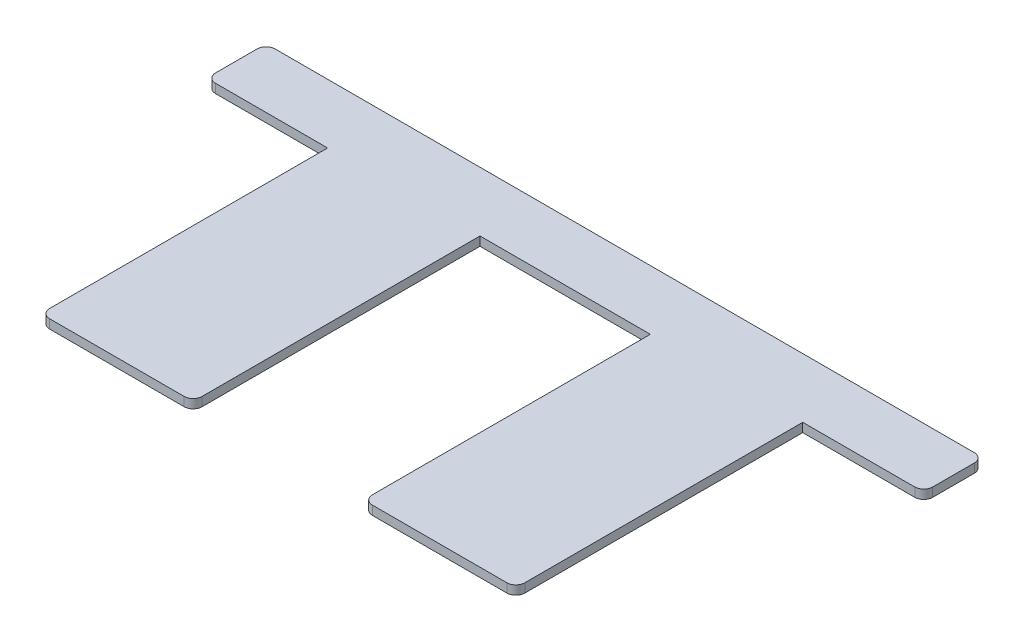
ISO-10303-21;
HEADER;
FILE_DESCRIPTION(('STEP AP214'),'2;1');
FILE_NAME('part.step','',(''),(''),'','','');
FILE_SCHEMA(('AUTOMOTIVE_DESIGN { 1 0 10303 214 1 1 1 1 }'));
ENDSEC;
DATA;
#1=APPLICATION_CONTEXT('core data for automotive mechanical design processes');
#2=APPLICATION_PROTOCOL_DEFINITION('international standard','automotive_design',2000,#1);
#3=PRODUCT_CONTEXT('',#1,'mechanical');
#4=PRODUCT('Part','Part','',(#3));
#5=PRODUCT_RELATED_PRODUCT_CATEGORY('part','',(#4));
#6=PRODUCT_DEFINITION_FORMATION('','',#4);
#7=PRODUCT_DEFINITION_CONTEXT('part definition',#1,'design');
#8=PRODUCT_DEFINITION('design','',#6,#7);
#9=PRODUCT_DEFINITION_SHAPE('','',#8);
#10=(LENGTH_UNIT() NAMED_UNIT(*) SI_UNIT(.MILLI.,.METRE.));
#11=(NAMED_UNIT(*) PLANE_ANGLE_UNIT() SI_UNIT($,.RADIAN.));
#12=(NAMED_UNIT(*) SI_UNIT($,.STERADIAN.) SOLID_ANGLE_UNIT());
#13=UNCERTAINTY_MEASURE_WITH_UNIT(LENGTH_MEASURE(1.E-05),#10,'distance_accuracy_value','');
#14=(GEOMETRIC_REPRESENTATION_CONTEXT(3) GLOBAL_UNCERTAINTY_ASSIGNED_CONTEXT((#13)) GLOBAL_UNIT_ASSIGNED_CONTEXT((#10,
#11,#12)) REPRESENTATION_CONTEXT('',''));
#15=CARTESIAN_POINT('',(0.,0.,0.));
#16=DIRECTION('',(0.,0.,1.));
#17=DIRECTION('',(1.,0.,0.));
#18=AXIS2_PLACEMENT_3D('',#15,#16,#17);
#19=CARTESIAN_POINT('',(0.,6.35,0.));
#20=DIRECTION('',(0.,1.,0.));
#21=DIRECTION('',(0.,0.,1.));
#22=AXIS2_PLACEMENT_3D('',#19,#20,#21);
#23=PLANE('',#22);
#24=DIRECTION('',(0.,0.,1.));
#25=VECTOR('',#24,1.);
#26=CARTESIAN_POINT('',(-254.,6.35,-21.082));
#27=LINE('',#26,#25);
#28=CARTESIAN_POINT('',(-254.,6.35,14.732));
#29=VERTEX_POINT('',#28);
#30=CARTESIAN_POINT('',(-254.,6.35,-14.732));
#31=VERTEX_POINT('',#30);
#32=EDGE_CURVE('E226',#29,#31,#27,.F.);
#33=ORIENTED_EDGE('',*,*,#32,.F.);
#34=CARTESIAN_POINT('',(-247.65,6.35,14.732));
#35=DIRECTION('',(0.,-1.,0.));
#36=DIRECTION('',(0.,0.,-1.));
#37=AXIS2_PLACEMENT_3D('',#34,#35,#36);
#38=CIRCLE('',#37,6.35);
#39=CARTESIAN_POINT('',(-247.65,6.35,21.082));
#40=VERTEX_POINT('',#39);
#41=EDGE_CURVE('E19',#40,#29,#38,.T.);
#42=ORIENTED_EDGE('',*,*,#41,.F.);
#43=DIRECTION('',(1.,0.,0.));
#44=VECTOR('',#43,1.);
#45=CARTESIAN_POINT('',(-254.,6.35,21.082));
#46=LINE('',#45,#44);
#47=CARTESIAN_POINT('',(-168.275,6.35,21.082));
#48=VERTEX_POINT('',#47);
#49=EDGE_CURVE('E134',#48,#40,#46,.F.);
#50=ORIENTED_EDGE('',*,*,#49,.F.);
#51=DIRECTION('',(0.,0.,1.));
#52=VECTOR('',#51,1.);
#53=CARTESIAN_POINT('',(-168.275,6.35,21.082));
#54=LINE('',#53,#52);
#55=CARTESIAN_POINT('',(-168.275,6.35,217.932));
#56=VERTEX_POINT('',#55);
#57=EDGE_CURVE('E141',#56,#48,#54,.F.);
#58=ORIENTED_EDGE('',*,*,#57,.F.);
#59=CARTESIAN_POINT('',(-161.925,6.35,217.932));
#60=DIRECTION('',(0.,-1.,0.));
#61=DIRECTION('',(0.,0.,-1.));
#62=AXIS2_PLACEMENT_3D('',#59,#60,#61);
#63=CIRCLE('',#62,6.35);
#64=CARTESIAN_POINT('',(-161.925,6.35,224.282));
#65=VERTEX_POINT('',#64);
#66=EDGE_CURVE('E281',#65,#56,#63,.T.);
#67=ORIENTED_EDGE('',*,*,#66,.F.);
#68=DIRECTION('',(1.,0.,0.));
#69=VECTOR('',#68,1.);
#70=CARTESIAN_POINT('',(0.,6.35,224.282));
#71=LINE('',#70,#69);
#72=CARTESIAN_POINT('',(-66.675,6.35,224.282));
#73=VERTEX_POINT('',#72);
#74=EDGE_CURVE('E278',#73,#65,#71,.F.);
#75=ORIENTED_EDGE('',*,*,#74,.F.);
#76=CARTESIAN_POINT('',(-66.675,6.35,217.932));
#77=DIRECTION('',(0.,1.,0.));
#78=DIRECTION('',(0.,0.,1.));
#79=AXIS2_PLACEMENT_3D('',#76,#77,#78);
#80=CIRCLE('',#79,6.35);
#81=CARTESIAN_POINT('',(-60.325,6.35,217.932));
#82=VERTEX_POINT('',#81);
#83=EDGE_CURVE('E275',#82,#73,#80,.F.);
#84=ORIENTED_EDGE('',*,*,#83,.F.);
#85=DIRECTION('',(0.,0.,-1.));
#86=VECTOR('',#85,1.);
#87=CARTESIAN_POINT('',(-60.325,6.35,21.082));
#88=LINE('',#87,#86);
#89=CARTESIAN_POINT('',(-60.325,6.35,21.082));
#90=VERTEX_POINT('',#89);
#91=EDGE_CURVE('E272',#90,#82,#88,.F.);
#92=ORIENTED_EDGE('',*,*,#91,.F.);
#93=DIRECTION('',(1.,0.,0.));
#94=VECTOR('',#93,1.);
#95=CARTESIAN_POINT('',(-254.,6.35,21.082));
#96=LINE('',#95,#94);
#97=CARTESIAN_POINT('',(60.325,6.35,21.082));
#98=VERTEX_POINT('',#97);
#99=EDGE_CURVE('E267',#98,#90,#96,.F.);
#100=ORIENTED_EDGE('',*,*,#99,.F.);
#101=DIRECTION('',(0.,0.,1.));
#102=VECTOR('',#101,1.);
#103=CARTESIAN_POINT('',(60.325,6.35,21.082));
#104=LINE('',#103,#102);
#105=CARTESIAN_POINT('',(60.325,6.35,217.932));
#106=VERTEX_POINT('',#105);
#107=EDGE_CURVE('E258',#106,#98,#104,.F.);
#108=ORIENTED_EDGE('',*,*,#107,.F.);
#109=CARTESIAN_POINT('',(66.675,6.35,217.932));
#110=DIRECTION('',(0.,-1.,0.));
#111=DIRECTION('',(0.,0.,-1.));
#112=AXIS2_PLACEMENT_3D('',#109,#110,#111);
#113=CIRCLE('',#112,6.35);
#114=CARTESIAN_POINT('',(66.675,6.35,224.282));
#115=VERTEX_POINT('',#114);
#116=EDGE_CURVE('E255',#115,#106,#113,.T.);
#117=ORIENTED_EDGE('',*,*,#116,.F.);
#118=DIRECTION('',(1.,0.,0.));
#119=VECTOR('',#118,1.);
#120=CARTESIAN_POINT('',(0.,6.35,224.282));
#121=LINE('',#120,#119);
#122=CARTESIAN_POINT('',(161.925,6.35,224.282));
#123=VERTEX_POINT('',#122);
#124=EDGE_CURVE('E252',#123,#115,#121,.F.);
#125=ORIENTED_EDGE('',*,*,#124,.F.);
#126=CARTESIAN_POINT('',(161.925,6.35,217.932));
#127=DIRECTION('',(0.,1.,0.));
#128=DIRECTION('',(0.,0.,1.));
#129=AXIS2_PLACEMENT_3D('',#126,#127,#128);
#130=CIRCLE('',#129,6.35);
#131=CARTESIAN_POINT('',(168.275,6.35,217.932));
#132=VERTEX_POINT('',#131);
#133=EDGE_CURVE('E249',#132,#123,#130,.F.);
#134=ORIENTED_EDGE('',*,*,#133,.F.);
#135=DIRECTION('',(0.,0.,-1.));
#136=VECTOR('',#135,1.);
#137=CARTESIAN_POINT('',(168.275,6.35,21.082));
#138=LINE('',#137,#136);
#139=CARTESIAN_POINT('',(168.275,6.35,21.082));
#140=VERTEX_POINT('',#139);
#141=EDGE_CURVE('E246',#140,#132,#138,.F.);
#142=ORIENTED_EDGE('',*,*,#141,.F.);
#143=DIRECTION('',(1.,0.,0.));
#144=VECTOR('',#143,1.);
#145=CARTESIAN_POINT('',(-254.,6.35,21.082));
#146=LINE('',#145,#144);
#147=CARTESIAN_POINT('',(247.65,6.35,21.082));
#148=VERTEX_POINT('',#147);
#149=EDGE_CURVE('E164',#148,#140,#146,.F.);
#150=ORIENTED_EDGE('',*,*,#149,.F.);
#151=CARTESIAN_POINT('',(247.65,6.35,14.732));
#152=DIRECTION('',(0.,-1.,0.));
#153=DIRECTION('',(0.,0.,-1.));
#154=AXIS2_PLACEMENT_3D('',#151,#152,#153);
#155=CIRCLE('',#154,6.35);
#156=CARTESIAN_POINT('',(254.,6.35,14.732));
#157=VERTEX_POINT('',#156);
#158=EDGE_CURVE('E168',#157,#148,#155,.T.);
#159=ORIENTED_EDGE('',*,*,#158,.F.);
#160=DIRECTION('',(0.,0.,-1.));
#161=VECTOR('',#160,1.);
#162=CARTESIAN_POINT('',(254.,6.35,21.082));
#163=LINE('',#162,#161);
#164=CARTESIAN_POINT('',(254.,6.35,-14.732));
#165=VERTEX_POINT('',#164);
#166=EDGE_CURVE('E240',#165,#157,#163,.F.);
#167=ORIENTED_EDGE('',*,*,#166,.F.);
#168=CARTESIAN_POINT('',(247.65,6.35,-14.732));
#169=DIRECTION('',(0.,-1.,0.));
#170=DIRECTION('',(0.,0.,-1.));
#171=AXIS2_PLACEMENT_3D('',#168,#169,#170);
#172=CIRCLE('',#171,6.35);
#173=CARTESIAN_POINT('',(247.65,6.35,-21.082));
#174=VERTEX_POINT('',#173);
#175=EDGE_CURVE('E237',#174,#165,#172,.T.);
#176=ORIENTED_EDGE('',*,*,#175,.F.);
#177=DIRECTION('',(-1.,0.,0.));
#178=VECTOR('',#177,1.);
#179=CARTESIAN_POINT('',(254.,6.35,-21.082));
#180=LINE('',#179,#178);
#181=CARTESIAN_POINT('',(-247.65,6.35,-21.082));
#182=VERTEX_POINT('',#181);
#183=EDGE_CURVE('E234',#182,#174,#180,.F.);
#184=ORIENTED_EDGE('',*,*,#183,.F.);
#185=CARTESIAN_POINT('',(-247.65,6.35,-14.732));
#186=DIRECTION('',(0.,-1.,0.));
#187=DIRECTION('',(0.,0.,-1.));
#188=AXIS2_PLACEMENT_3D('',#185,#186,#187);
#189=CIRCLE('',#188,6.35);
#190=EDGE_CURVE('E231',#31,#182,#189,.T.);
#191=ORIENTED_EDGE('',*,*,#190,.F.);
#192=EDGE_LOOP('',(#33,#42,#50,#58,#67,#75,#84,#92,#100,#108,#117,#125,#134,#142,#150,#159,#167,
#176,#184,#191));
#193=FACE_BOUND('',#192,.T.);
#194=ADVANCED_FACE('F16',(#193),#23,.T.);
#195=CARTESIAN_POINT('',(-247.65,14.62786,14.732));
#196=DIRECTION('',(0.,-1.,0.));
#197=DIRECTION('',(0.,0.,-1.));
#198=AXIS2_PLACEMENT_3D('',#195,#196,#197);
#199=CYLINDRICAL_SURFACE('',#198,6.35);
#200=DIRECTION('',(0.,1.,0.));
#201=VECTOR('',#200,1.);
#202=CARTESIAN_POINT('',(-254.,0.,14.732));
#203=LINE('',#202,#201);
#204=CARTESIAN_POINT('',(-254.,0.,14.732));
#205=VERTEX_POINT('',#204);
#206=EDGE_CURVE('E225',#205,#29,#203,.T.);
#207=ORIENTED_EDGE('',*,*,#206,.F.);
#208=CARTESIAN_POINT('',(-247.65,0.,14.732));
#209=DIRECTION('',(0.,-1.,0.));
#210=DIRECTION('',(0.,0.,-1.));
#211=AXIS2_PLACEMENT_3D('',#208,#209,#210);
#212=CIRCLE('',#211,6.35);
#213=CARTESIAN_POINT('',(-247.65,0.,21.082));
#214=VERTEX_POINT('',#213);
#215=EDGE_CURVE('E221',#205,#214,#212,.F.);
#216=ORIENTED_EDGE('',*,*,#215,.T.);
#217=DIRECTION('',(0.,1.,0.));
#218=VECTOR('',#217,1.);
#219=CARTESIAN_POINT('',(-247.65,0.,21.082));
#220=LINE('',#219,#218);
#221=EDGE_CURVE('E286',#40,#214,#220,.F.);
#222=ORIENTED_EDGE('',*,*,#221,.F.);
#223=ORIENTED_EDGE('',*,*,#41,.T.);
#224=EDGE_LOOP('',(#207,#216,#222,#223));
#225=FACE_BOUND('',#224,.T.);
#226=ADVANCED_FACE('F353',(#225),#199,.T.);
#227=CARTESIAN_POINT('',(-254.,0.,21.082));
#228=DIRECTION('',(0.,0.,1.));
#229=DIRECTION('',(1.,0.,0.));
#230=AXIS2_PLACEMENT_3D('',#227,#228,#229);
#231=PLANE('',#230);
#232=ORIENTED_EDGE('',*,*,#49,.T.);
#233=ORIENTED_EDGE('',*,*,#221,.T.);
#234=DIRECTION('',(1.,0.,0.));
#235=VECTOR('',#234,1.);
#236=CARTESIAN_POINT('',(0.,0.,21.082));
#237=LINE('',#236,#235);
#238=CARTESIAN_POINT('',(-168.275,0.,21.082));
#239=VERTEX_POINT('',#238);
#240=EDGE_CURVE('E216',#214,#239,#237,.T.);
#241=ORIENTED_EDGE('',*,*,#240,.T.);
#242=DIRECTION('',(0.,1.,0.));
#243=VECTOR('',#242,1.);
#244=CARTESIAN_POINT('',(-168.275,6.35,21.082));
#245=LINE('',#244,#243);
#246=EDGE_CURVE('E282',#48,#239,#245,.F.);
#247=ORIENTED_EDGE('',*,*,#246,.F.);
#248=EDGE_LOOP('',(#232,#233,#241,#247));
#249=FACE_BOUND('',#248,.T.);
#250=ADVANCED_FACE('F348',(#249),#231,.T.);
#251=CARTESIAN_POINT('',(-168.275,6.35,21.082));
#252=DIRECTION('',(-1.,0.,0.));
#253=DIRECTION('',(0.,0.,1.));
#254=AXIS2_PLACEMENT_3D('',#251,#252,#253);
#255=PLANE('',#254);
#256=DIRECTION('',(0.,0.,1.));
#257=VECTOR('',#256,1.);
#258=CARTESIAN_POINT('',(-168.275,0.,0.));
#259=LINE('',#258,#257);
#260=CARTESIAN_POINT('',(-168.275,0.,217.932));
#261=VERTEX_POINT('',#260);
#262=EDGE_CURVE('E213',#239,#261,#259,.T.);
#263=ORIENTED_EDGE('',*,*,#262,.T.);
#264=DIRECTION('',(0.,-1.,0.));
#265=VECTOR('',#264,1.);
#266=CARTESIAN_POINT('',(-168.275,14.62786,217.932));
#267=LINE('',#266,#265);
#268=EDGE_CURVE('E279',#56,#261,#267,.T.);
#269=ORIENTED_EDGE('',*,*,#268,.F.);
#270=ORIENTED_EDGE('',*,*,#57,.T.);
#271=ORIENTED_EDGE('',*,*,#246,.T.);
#272=EDGE_LOOP('',(#263,#269,#270,#271));
#273=FACE_BOUND('',#272,.T.);
#274=ADVANCED_FACE('F344',(#273),#255,.T.);
#275=CARTESIAN_POINT('',(-161.925,14.62786,217.932));
#276=DIRECTION('',(0.,-1.,0.));
#277=DIRECTION('',(0.,0.,-1.));
#278=AXIS2_PLACEMENT_3D('',#275,#276,#277);
#279=CYLINDRICAL_SURFACE('',#278,6.35);
#280=ORIENTED_EDGE('',*,*,#268,.T.);
#281=CARTESIAN_POINT('',(-161.925,0.,217.932));
#282=DIRECTION('',(0.,-1.,0.));
#283=DIRECTION('',(0.,0.,-1.));
#284=AXIS2_PLACEMENT_3D('',#281,#282,#283);
#285=CIRCLE('',#284,6.35);
#286=CARTESIAN_POINT('',(-161.925,0.,224.282));
#287=VERTEX_POINT('',#286);
#288=EDGE_CURVE('E212',#261,#287,#285,.F.);
#289=ORIENTED_EDGE('',*,*,#288,.T.);
#290=DIRECTION('',(0.,1.,0.));
#291=VECTOR('',#290,1.);
#292=CARTESIAN_POINT('',(-161.925,0.,224.282));
#293=LINE('',#292,#291);
#294=EDGE_CURVE('E276',#65,#287,#293,.F.);
#295=ORIENTED_EDGE('',*,*,#294,.F.);
#296=ORIENTED_EDGE('',*,*,#66,.T.);
#297=EDGE_LOOP('',(#280,#289,#295,#296));
#298=FACE_BOUND('',#297,.T.);
#299=ADVANCED_FACE('F340',(#298),#279,.T.);
#300=CARTESIAN_POINT('',(0.,0.,224.282));
#301=DIRECTION('',(0.,0.,1.));
#302=DIRECTION('',(1.,0.,0.));
#303=AXIS2_PLACEMENT_3D('',#300,#301,#302);
#304=PLANE('',#303);
#305=DIRECTION('',(1.,0.,0.));
#306=VECTOR('',#305,1.);
#307=CARTESIAN_POINT('',(0.,0.,224.282));
#308=LINE('',#307,#306);
#309=CARTESIAN_POINT('',(-66.675,0.,224.282));
#310=VERTEX_POINT('',#309);
#311=EDGE_CURVE('E209',#287,#310,#308,.T.);
#312=ORIENTED_EDGE('',*,*,#311,.T.);
#313=DIRECTION('',(0.,1.,0.));
#314=VECTOR('',#313,1.);
#315=CARTESIAN_POINT('',(-66.675,-8.27786,224.282));
#316=LINE('',#315,#314);
#317=EDGE_CURVE('E273',#73,#310,#316,.F.);
#318=ORIENTED_EDGE('',*,*,#317,.F.);
#319=ORIENTED_EDGE('',*,*,#74,.T.);
#320=ORIENTED_EDGE('',*,*,#294,.T.);
#321=EDGE_LOOP('',(#312,#318,#319,#320));
#322=FACE_BOUND('',#321,.T.);
#323=ADVANCED_FACE('F411',(#322),#304,.T.);
#324=CARTESIAN_POINT('',(-66.675,-8.27786,217.932));
#325=DIRECTION('',(0.,1.,0.));
#326=DIRECTION('',(0.,0.,1.));
#327=AXIS2_PLACEMENT_3D('',#324,#325,#326);
#328=CYLINDRICAL_SURFACE('',#327,6.35);
#329=DIRECTION('',(0.,1.,0.));
#330=VECTOR('',#329,1.);
#331=CARTESIAN_POINT('',(-60.325,0.,217.932));
#332=LINE('',#331,#330);
#333=CARTESIAN_POINT('',(-60.325,0.,217.932));
#334=VERTEX_POINT('',#333);
#335=EDGE_CURVE('E270',#82,#334,#332,.F.);
#336=ORIENTED_EDGE('',*,*,#335,.F.);
#337=ORIENTED_EDGE('',*,*,#83,.T.);
#338=ORIENTED_EDGE('',*,*,#317,.T.);
#339=CARTESIAN_POINT('',(-66.675,0.,217.932));
#340=DIRECTION('',(0.,1.,0.));
#341=DIRECTION('',(0.,0.,1.));
#342=AXIS2_PLACEMENT_3D('',#339,#340,#341);
#343=CIRCLE('',#342,6.35);
#344=EDGE_CURVE('E206',#310,#334,#343,.T.);
#345=ORIENTED_EDGE('',*,*,#344,.T.);
#346=EDGE_LOOP('',(#336,#337,#338,#345));
#347=FACE_BOUND('',#346,.T.);
#348=ADVANCED_FACE('F408',(#347),#328,.T.);
#349=CARTESIAN_POINT('',(-60.325,0.,21.082));
#350=DIRECTION('',(1.,0.,0.));
#351=DIRECTION('',(0.,0.,-1.));
#352=AXIS2_PLACEMENT_3D('',#349,#350,#351);
#353=PLANE('',#352);
#354=ORIENTED_EDGE('',*,*,#91,.T.);
#355=ORIENTED_EDGE('',*,*,#335,.T.);
#356=DIRECTION('',(0.,0.,1.));
#357=VECTOR('',#356,1.);
#358=CARTESIAN_POINT('',(-60.325,0.,0.));
#359=LINE('',#358,#357);
#360=CARTESIAN_POINT('',(-60.325,0.,21.082));
#361=VERTEX_POINT('',#360);
#362=EDGE_CURVE('E203',#334,#361,#359,.F.);
#363=ORIENTED_EDGE('',*,*,#362,.T.);
#364=DIRECTION('',(0.,1.,0.));
#365=VECTOR('',#364,1.);
#366=CARTESIAN_POINT('',(-60.325,0.,21.082));
#367=LINE('',#366,#365);
#368=EDGE_CURVE('E265',#90,#361,#367,.F.);
#369=ORIENTED_EDGE('',*,*,#368,.F.);
#370=EDGE_LOOP('',(#354,#355,#363,#369));
#371=FACE_BOUND('',#370,.T.);
#372=ADVANCED_FACE('F404',(#371),#353,.T.);
#373=CARTESIAN_POINT('',(-254.,0.,21.082));
#374=DIRECTION('',(0.,0.,1.));
#375=DIRECTION('',(1.,0.,0.));
#376=AXIS2_PLACEMENT_3D('',#373,#374,#375);
#377=PLANE('',#376);
#378=DIRECTION('',(1.,0.,0.));
#379=VECTOR('',#378,1.);
#380=CARTESIAN_POINT('',(0.,0.,21.082));
#381=LINE('',#380,#379);
#382=CARTESIAN_POINT('',(60.325,0.,21.082));
#383=VERTEX_POINT('',#382);
#384=EDGE_CURVE('E200',#361,#383,#381,.T.);
#385=ORIENTED_EDGE('',*,*,#384,.T.);
#386=DIRECTION('',(0.,1.,0.));
#387=VECTOR('',#386,1.);
#388=CARTESIAN_POINT('',(60.325,6.35,21.082));
#389=LINE('',#388,#387);
#390=EDGE_CURVE('E256',#98,#383,#389,.F.);
#391=ORIENTED_EDGE('',*,*,#390,.F.);
#392=ORIENTED_EDGE('',*,*,#99,.T.);
#393=ORIENTED_EDGE('',*,*,#368,.T.);
#394=EDGE_LOOP('',(#385,#391,#392,#393));
#395=FACE_BOUND('',#394,.T.);
#396=ADVANCED_FACE('F398',(#395),#377,.T.);
#397=CARTESIAN_POINT('',(60.325,6.35,21.082));
#398=DIRECTION('',(-1.,0.,0.));
#399=DIRECTION('',(0.,0.,1.));
#400=AXIS2_PLACEMENT_3D('',#397,#398,#399);
#401=PLANE('',#400);
#402=DIRECTION('',(0.,0.,1.));
#403=VECTOR('',#402,1.);
#404=CARTESIAN_POINT('',(60.325,0.,0.));
#405=LINE('',#404,#403);
#406=CARTESIAN_POINT('',(60.325,0.,217.932));
#407=VERTEX_POINT('',#406);
#408=EDGE_CURVE('E197',#383,#407,#405,.T.);
#409=ORIENTED_EDGE('',*,*,#408,.T.);
#410=DIRECTION('',(0.,-1.,0.));
#411=VECTOR('',#410,1.);
#412=CARTESIAN_POINT('',(60.325,14.62786,217.932));
#413=LINE('',#412,#411);
#414=EDGE_CURVE('E253',#106,#407,#413,.T.);
#415=ORIENTED_EDGE('',*,*,#414,.F.);
#416=ORIENTED_EDGE('',*,*,#107,.T.);
#417=ORIENTED_EDGE('',*,*,#390,.T.);
#418=EDGE_LOOP('',(#409,#415,#416,#417));
#419=FACE_BOUND('',#418,.T.);
#420=ADVANCED_FACE('F394',(#419),#401,.T.);
#421=CARTESIAN_POINT('',(66.675,14.62786,217.932));
#422=DIRECTION('',(0.,-1.,0.));
#423=DIRECTION('',(0.,0.,-1.));
#424=AXIS2_PLACEMENT_3D('',#421,#422,#423);
#425=CYLINDRICAL_SURFACE('',#424,6.35);
#426=ORIENTED_EDGE('',*,*,#414,.T.);
#427=CARTESIAN_POINT('',(66.675,0.,217.932));
#428=DIRECTION('',(0.,-1.,0.));
#429=DIRECTION('',(0.,0.,-1.));
#430=AXIS2_PLACEMENT_3D('',#427,#428,#429);
#431=CIRCLE('',#430,6.35);
#432=CARTESIAN_POINT('',(66.675,0.,224.282));
#433=VERTEX_POINT('',#432);
#434=EDGE_CURVE('E196',#407,#433,#431,.F.);
#435=ORIENTED_EDGE('',*,*,#434,.T.);
#436=DIRECTION('',(0.,1.,0.));
#437=VECTOR('',#436,1.);
#438=CARTESIAN_POINT('',(66.675,0.,224.282));
#439=LINE('',#438,#437);
#440=EDGE_CURVE('E250',#115,#433,#439,.F.);
#441=ORIENTED_EDGE('',*,*,#440,.F.);
#442=ORIENTED_EDGE('',*,*,#116,.T.);
#443=EDGE_LOOP('',(#426,#435,#441,#442));
#444=FACE_BOUND('',#443,.T.);
#445=ADVANCED_FACE('F388',(#444),#425,.T.);
#446=CARTESIAN_POINT('',(0.,0.,224.282));
#447=DIRECTION('',(0.,0.,1.));
#448=DIRECTION('',(1.,0.,0.));
#449=AXIS2_PLACEMENT_3D('',#446,#447,#448);
#450=PLANE('',#449);
#451=DIRECTION('',(1.,0.,0.));
#452=VECTOR('',#451,1.);
#453=CARTESIAN_POINT('',(0.,0.,224.282));
#454=LINE('',#453,#452);
#455=CARTESIAN_POINT('',(161.925,0.,224.282));
#456=VERTEX_POINT('',#455);
#457=EDGE_CURVE('E187',#433,#456,#454,.T.);
#458=ORIENTED_EDGE('',*,*,#457,.T.);
#459=DIRECTION('',(0.,1.,0.));
#460=VECTOR('',#459,1.);
#461=CARTESIAN_POINT('',(161.925,-8.27786,224.282));
#462=LINE('',#461,#460);
#463=EDGE_CURVE('E247',#123,#456,#462,.F.);
#464=ORIENTED_EDGE('',*,*,#463,.F.);
#465=ORIENTED_EDGE('',*,*,#124,.T.);
#466=ORIENTED_EDGE('',*,*,#440,.T.);
#467=EDGE_LOOP('',(#458,#464,#465,#466));
#468=FACE_BOUND('',#467,.T.);
#469=ADVANCED_FACE('F385',(#468),#450,.T.);
#470=CARTESIAN_POINT('',(161.925,-8.27786,217.932));
#471=DIRECTION('',(0.,1.,0.));
#472=DIRECTION('',(0.,0.,1.));
#473=AXIS2_PLACEMENT_3D('',#470,#471,#472);
#474=CYLINDRICAL_SURFACE('',#473,6.35);
#475=DIRECTION('',(0.,1.,0.));
#476=VECTOR('',#475,1.);
#477=CARTESIAN_POINT('',(168.275,0.,217.932));
#478=LINE('',#477,#476);
#479=CARTESIAN_POINT('',(168.275,0.,217.932));
#480=VERTEX_POINT('',#479);
#481=EDGE_CURVE('E184',#132,#480,#478,.F.);
#482=ORIENTED_EDGE('',*,*,#481,.F.);
#483=ORIENTED_EDGE('',*,*,#133,.T.);
#484=ORIENTED_EDGE('',*,*,#463,.T.);
#485=CARTESIAN_POINT('',(161.925,0.,217.932));
#486=DIRECTION('',(0.,1.,0.));
#487=DIRECTION('',(0.,0.,1.));
#488=AXIS2_PLACEMENT_3D('',#485,#486,#487);
#489=CIRCLE('',#488,6.35);
#490=EDGE_CURVE('E185',#456,#480,#489,.T.);
#491=ORIENTED_EDGE('',*,*,#490,.T.);
#492=EDGE_LOOP('',(#482,#483,#484,#491));
#493=FACE_BOUND('',#492,.T.);
#494=ADVANCED_FACE('F381',(#493),#474,.T.);
#495=CARTESIAN_POINT('',(168.275,0.,21.082));
#496=DIRECTION('',(1.,0.,0.));
#497=DIRECTION('',(0.,0.,-1.));
#498=AXIS2_PLACEMENT_3D('',#495,#496,#497);
#499=PLANE('',#498);
#500=ORIENTED_EDGE('',*,*,#141,.T.);
#501=ORIENTED_EDGE('',*,*,#481,.T.);
#502=DIRECTION('',(0.,0.,1.));
#503=VECTOR('',#502,1.);
#504=CARTESIAN_POINT('',(168.275,0.,0.));
#505=LINE('',#504,#503);
#506=CARTESIAN_POINT('',(168.275,0.,21.082));
#507=VERTEX_POINT('',#506);
#508=EDGE_CURVE('E176',#480,#507,#505,.F.);
#509=ORIENTED_EDGE('',*,*,#508,.T.);
#510=DIRECTION('',(0.,1.,0.));
#511=VECTOR('',#510,1.);
#512=CARTESIAN_POINT('',(168.275,0.,21.082));
#513=LINE('',#512,#511);
#514=EDGE_CURVE('E158',#140,#507,#513,.F.);
#515=ORIENTED_EDGE('',*,*,#514,.F.);
#516=EDGE_LOOP('',(#500,#501,#509,#515));
#517=FACE_BOUND('',#516,.T.);
#518=ADVANCED_FACE('F182',(#517),#499,.T.);
#519=CARTESIAN_POINT('',(-254.,0.,21.082));
#520=DIRECTION('',(0.,0.,1.));
#521=DIRECTION('',(1.,0.,0.));
#522=AXIS2_PLACEMENT_3D('',#519,#520,#521);
#523=PLANE('',#522);
#524=DIRECTION('',(1.,0.,0.));
#525=VECTOR('',#524,1.);
#526=CARTESIAN_POINT('',(0.,0.,21.082));
#527=LINE('',#526,#525);
#528=CARTESIAN_POINT('',(247.65,0.,21.082));
#529=VERTEX_POINT('',#528);
#530=EDGE_CURVE('E162',#507,#529,#527,.T.);
#531=ORIENTED_EDGE('',*,*,#530,.T.);
#532=DIRECTION('',(0.,-1.,0.));
#533=VECTOR('',#532,1.);
#534=CARTESIAN_POINT('',(247.65,14.62786,21.082));
#535=LINE('',#534,#533);
#536=EDGE_CURVE('E241',#148,#529,#535,.T.);
#537=ORIENTED_EDGE('',*,*,#536,.F.);
#538=ORIENTED_EDGE('',*,*,#149,.T.);
#539=ORIENTED_EDGE('',*,*,#514,.T.);
#540=EDGE_LOOP('',(#531,#537,#538,#539));
#541=FACE_BOUND('',#540,.T.);
#542=ADVANCED_FACE('F160',(#541),#523,.T.);
#543=CARTESIAN_POINT('',(247.65,14.62786,14.732));
#544=DIRECTION('',(0.,-1.,0.));
#545=DIRECTION('',(0.,0.,-1.));
#546=AXIS2_PLACEMENT_3D('',#543,#544,#545);
#547=CYLINDRICAL_SURFACE('',#546,6.35);
#548=ORIENTED_EDGE('',*,*,#536,.T.);
#549=CARTESIAN_POINT('',(247.65,0.,14.732));
#550=DIRECTION('',(0.,-1.,0.));
#551=DIRECTION('',(0.,0.,-1.));
#552=AXIS2_PLACEMENT_3D('',#549,#550,#551);
#553=CIRCLE('',#552,6.35);
#554=CARTESIAN_POINT('',(254.,0.,14.732));
#555=VERTEX_POINT('',#554);
#556=EDGE_CURVE('E180',#529,#555,#553,.F.);
#557=ORIENTED_EDGE('',*,*,#556,.T.);
#558=DIRECTION('',(0.,1.,0.));
#559=VECTOR('',#558,1.);
#560=CARTESIAN_POINT('',(254.,0.,14.732));
#561=LINE('',#560,#559);
#562=EDGE_CURVE('E238',#157,#555,#561,.F.);
#563=ORIENTED_EDGE('',*,*,#562,.F.);
#564=ORIENTED_EDGE('',*,*,#158,.T.);
#565=EDGE_LOOP('',(#548,#557,#563,#564));
#566=FACE_BOUND('',#565,.T.);
#567=ADVANCED_FACE('F374',(#566),#547,.T.);
#568=CARTESIAN_POINT('',(254.,0.,21.082));
#569=DIRECTION('',(1.,0.,0.));
#570=DIRECTION('',(0.,0.,-1.));
#571=AXIS2_PLACEMENT_3D('',#568,#569,#570);
#572=PLANE('',#571);
#573=DIRECTION('',(0.,0.,1.));
#574=VECTOR('',#573,1.);
#575=CARTESIAN_POINT('',(254.,0.,0.));
#576=LINE('',#575,#574);
#577=CARTESIAN_POINT('',(254.,0.,-14.732));
#578=VERTEX_POINT('',#577);
#579=EDGE_CURVE('E320',#555,#578,#576,.F.);
#580=ORIENTED_EDGE('',*,*,#579,.T.);
#581=DIRECTION('',(0.,-1.,0.));
#582=VECTOR('',#581,1.);
#583=CARTESIAN_POINT('',(254.,14.62786,-14.732));
#584=LINE('',#583,#582);
#585=EDGE_CURVE('E235',#165,#578,#584,.T.);
#586=ORIENTED_EDGE('',*,*,#585,.F.);
#587=ORIENTED_EDGE('',*,*,#166,.T.);
#588=ORIENTED_EDGE('',*,*,#562,.T.);
#589=EDGE_LOOP('',(#580,#586,#587,#588));
#590=FACE_BOUND('',#589,.T.);
#591=ADVANCED_FACE('F371',(#590),#572,.T.);
#592=CARTESIAN_POINT('',(247.65,14.62786,-14.732));
#593=DIRECTION('',(0.,-1.,0.));
#594=DIRECTION('',(0.,0.,-1.));
#595=AXIS2_PLACEMENT_3D('',#592,#593,#594);
#596=CYLINDRICAL_SURFACE('',#595,6.35);
#597=ORIENTED_EDGE('',*,*,#585,.T.);
#598=CARTESIAN_POINT('',(247.65,0.,-14.732));
#599=DIRECTION('',(0.,-1.,0.));
#600=DIRECTION('',(0.,0.,-1.));
#601=AXIS2_PLACEMENT_3D('',#598,#599,#600);
#602=CIRCLE('',#601,6.35);
#603=CARTESIAN_POINT('',(247.65,0.,-21.082));
#604=VERTEX_POINT('',#603);
#605=EDGE_CURVE('E317',#578,#604,#602,.F.);
#606=ORIENTED_EDGE('',*,*,#605,.T.);
#607=DIRECTION('',(0.,1.,0.));
#608=VECTOR('',#607,1.);
#609=CARTESIAN_POINT('',(247.65,0.,-21.082));
#610=LINE('',#609,#608);
#611=EDGE_CURVE('E232',#174,#604,#610,.F.);
#612=ORIENTED_EDGE('',*,*,#611,.F.);
#613=ORIENTED_EDGE('',*,*,#175,.T.);
#614=EDGE_LOOP('',(#597,#606,#612,#613));
#615=FACE_BOUND('',#614,.T.);
#616=ADVANCED_FACE('F433',(#615),#596,.T.);
#617=CARTESIAN_POINT('',(254.,0.,-21.082));
#618=DIRECTION('',(0.,0.,-1.));
#619=DIRECTION('',(-1.,0.,0.));
#620=AXIS2_PLACEMENT_3D('',#617,#618,#619);
#621=PLANE('',#620);
#622=DIRECTION('',(1.,0.,0.));
#623=VECTOR('',#622,1.);
#624=CARTESIAN_POINT('',(0.,0.,-21.082));
#625=LINE('',#624,#623);
#626=CARTESIAN_POINT('',(-247.65,0.,-21.082));
#627=VERTEX_POINT('',#626);
#628=EDGE_CURVE('E316',#604,#627,#625,.F.);
#629=ORIENTED_EDGE('',*,*,#628,.T.);
#630=DIRECTION('',(0.,-1.,0.));
#631=VECTOR('',#630,1.);
#632=CARTESIAN_POINT('',(-247.65,14.62786,-21.082));
#633=LINE('',#632,#631);
#634=EDGE_CURVE('E229',#182,#627,#633,.T.);
#635=ORIENTED_EDGE('',*,*,#634,.F.);
#636=ORIENTED_EDGE('',*,*,#183,.T.);
#637=ORIENTED_EDGE('',*,*,#611,.T.);
#638=EDGE_LOOP('',(#629,#635,#636,#637));
#639=FACE_BOUND('',#638,.T.);
#640=ADVANCED_FACE('F362',(#639),#621,.T.);
#641=CARTESIAN_POINT('',(-247.65,14.62786,-14.732));
#642=DIRECTION('',(0.,-1.,0.));
#643=DIRECTION('',(0.,0.,-1.));
#644=AXIS2_PLACEMENT_3D('',#641,#642,#643);
#645=CYLINDRICAL_SURFACE('',#644,6.35);
#646=ORIENTED_EDGE('',*,*,#634,.T.);
#647=CARTESIAN_POINT('',(-247.65,0.,-14.732));
#648=DIRECTION('',(0.,-1.,0.));
#649=DIRECTION('',(0.,0.,-1.));
#650=AXIS2_PLACEMENT_3D('',#647,#648,#649);
#651=CIRCLE('',#650,6.35);
#652=CARTESIAN_POINT('',(-254.,0.,-14.732));
#653=VERTEX_POINT('',#652);
#654=EDGE_CURVE('E25',#627,#653,#651,.F.);
#655=ORIENTED_EDGE('',*,*,#654,.T.);
#656=DIRECTION('',(0.,1.,0.));
#657=VECTOR('',#656,1.);
#658=CARTESIAN_POINT('',(-254.,0.,-14.732));
#659=LINE('',#658,#657);
#660=EDGE_CURVE('E33',#31,#653,#659,.F.);
#661=ORIENTED_EDGE('',*,*,#660,.F.);
#662=ORIENTED_EDGE('',*,*,#190,.T.);
#663=EDGE_LOOP('',(#646,#655,#661,#662));
#664=FACE_BOUND('',#663,.T.);
#665=ADVANCED_FACE('F357',(#664),#645,.T.);
#666=CARTESIAN_POINT('',(-254.,0.,-21.082));
#667=DIRECTION('',(-1.,0.,0.));
#668=DIRECTION('',(0.,0.,1.));
#669=AXIS2_PLACEMENT_3D('',#666,#667,#668);
#670=PLANE('',#669);
#671=DIRECTION('',(0.,0.,1.));
#672=VECTOR('',#671,1.);
#673=CARTESIAN_POINT('',(-254.,0.,0.));
#674=LINE('',#673,#672);
#675=EDGE_CURVE('E11',#653,#205,#674,.T.);
#676=ORIENTED_EDGE('',*,*,#675,.T.);
#677=ORIENTED_EDGE('',*,*,#206,.T.);
#678=ORIENTED_EDGE('',*,*,#32,.T.);
#679=ORIENTED_EDGE('',*,*,#660,.T.);
#680=EDGE_LOOP('',(#676,#677,#678,#679));
#681=FACE_BOUND('',#680,.T.);
#682=ADVANCED_FACE('F422',(#681),#670,.T.);
#683=CARTESIAN_POINT('',(0.,0.,0.));
#684=DIRECTION('',(0.,1.,0.));
#685=DIRECTION('',(0.,0.,1.));
#686=AXIS2_PLACEMENT_3D('',#683,#684,#685);
#687=PLANE('',#686);
#688=ORIENTED_EDGE('',*,*,#654,.F.);
#689=ORIENTED_EDGE('',*,*,#628,.F.);
#690=ORIENTED_EDGE('',*,*,#605,.F.);
#691=ORIENTED_EDGE('',*,*,#579,.F.);
#692=ORIENTED_EDGE('',*,*,#556,.F.);
#693=ORIENTED_EDGE('',*,*,#530,.F.);
#694=ORIENTED_EDGE('',*,*,#508,.F.);
#695=ORIENTED_EDGE('',*,*,#490,.F.);
#696=ORIENTED_EDGE('',*,*,#457,.F.);
#697=ORIENTED_EDGE('',*,*,#434,.F.);
#698=ORIENTED_EDGE('',*,*,#408,.F.);
#699=ORIENTED_EDGE('',*,*,#384,.F.);
#700=ORIENTED_EDGE('',*,*,#362,.F.);
#701=ORIENTED_EDGE('',*,*,#344,.F.);
#702=ORIENTED_EDGE('',*,*,#311,.F.);
#703=ORIENTED_EDGE('',*,*,#288,.F.);
#704=ORIENTED_EDGE('',*,*,#262,.F.);
#705=ORIENTED_EDGE('',*,*,#240,.F.);
#706=ORIENTED_EDGE('',*,*,#215,.F.);
#707=ORIENTED_EDGE('',*,*,#675,.F.);
#708=EDGE_LOOP('',(#688,#689,#690,#691,#692,#693,#694,#695,#696,#697,#698,#699,#700,#701,#702,
#703,#704,#705,#706,#707));
#709=FACE_BOUND('',#708,.T.);
#710=ADVANCED_FACE('F174',(#709),#687,.F.);
#711=CLOSED_SHELL('',(#194,#226,#250,#274,#299,#323,#348,#372,#396,#420,#445,#469,#494,#518,
#542,#567,#591,#616,#640,#665,#682,#710));
#712=MANIFOLD_SOLID_BREP('B1',#711);
#713=ADVANCED_BREP_SHAPE_REPRESENTATION('',(#18,#712),#14);
#714=SHAPE_DEFINITION_REPRESENTATION(#9,#713);
ENDSEC;
END-ISO-10303-21;
